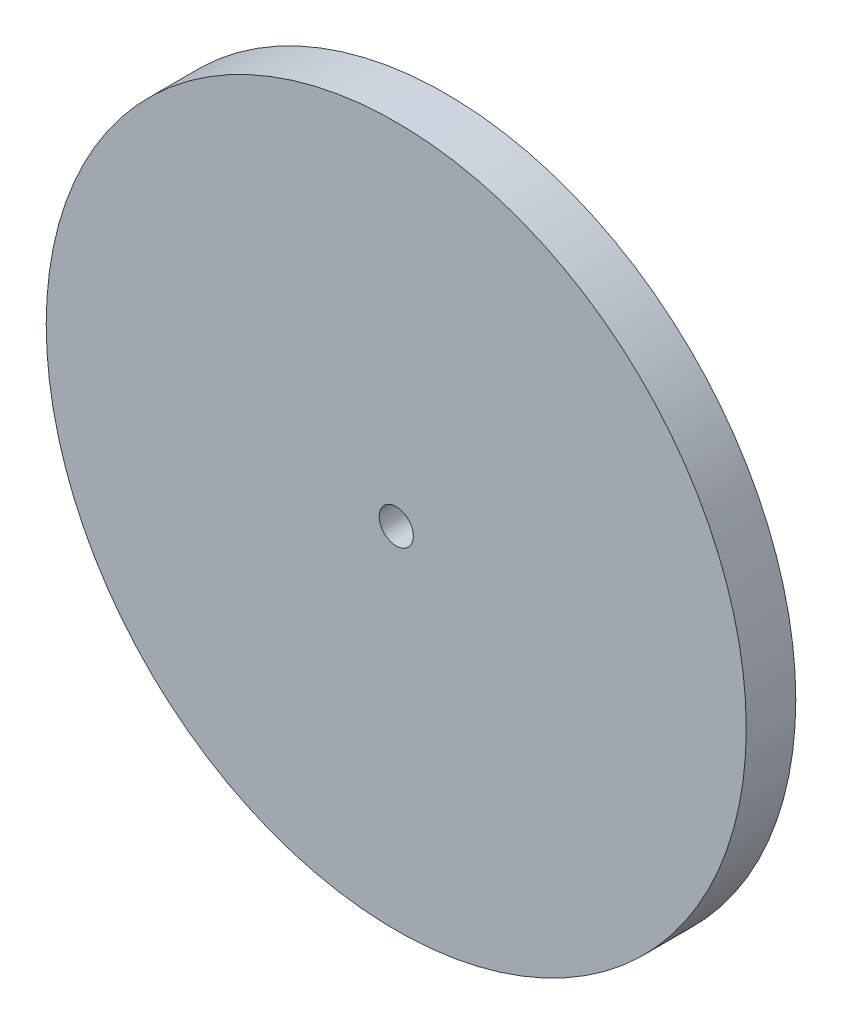
ISO-10303-21;
HEADER;
FILE_DESCRIPTION(('STEP AP214'),'2;1');
FILE_NAME('part.step','',(''),(''),'','','');
FILE_SCHEMA(('AUTOMOTIVE_DESIGN { 1 0 10303 214 1 1 1 1 }'));
ENDSEC;
DATA;
#1=APPLICATION_CONTEXT('core data for automotive mechanical design processes');
#2=APPLICATION_PROTOCOL_DEFINITION('international standard','automotive_design',2000,#1);
#3=PRODUCT_CONTEXT('',#1,'mechanical');
#4=PRODUCT('Part','Part','',(#3));
#5=PRODUCT_RELATED_PRODUCT_CATEGORY('part','',(#4));
#6=PRODUCT_DEFINITION_FORMATION('','',#4);
#7=PRODUCT_DEFINITION_CONTEXT('part definition',#1,'design');
#8=PRODUCT_DEFINITION('design','',#6,#7);
#9=PRODUCT_DEFINITION_SHAPE('','',#8);
#10=(LENGTH_UNIT() NAMED_UNIT(*) SI_UNIT(.MILLI.,.METRE.));
#11=(NAMED_UNIT(*) PLANE_ANGLE_UNIT() SI_UNIT($,.RADIAN.));
#12=(NAMED_UNIT(*) SI_UNIT($,.STERADIAN.) SOLID_ANGLE_UNIT());
#13=UNCERTAINTY_MEASURE_WITH_UNIT(LENGTH_MEASURE(1.E-05),#10,'distance_accuracy_value','');
#14=(GEOMETRIC_REPRESENTATION_CONTEXT(3) GLOBAL_UNCERTAINTY_ASSIGNED_CONTEXT((#13)) GLOBAL_UNIT_ASSIGNED_CONTEXT((#10,
#11,#12)) REPRESENTATION_CONTEXT('',''));
#15=CARTESIAN_POINT('',(0.,0.,0.));
#16=DIRECTION('',(0.,0.,1.));
#17=DIRECTION('',(1.,0.,0.));
#18=AXIS2_PLACEMENT_3D('',#15,#16,#17);
#19=CARTESIAN_POINT('',(0.,0.,5.8));
#20=DIRECTION('',(0.,0.,1.));
#21=DIRECTION('',(1.,0.,0.));
#22=AXIS2_PLACEMENT_3D('',#19,#20,#21);
#23=PLANE('',#22);
#24=CARTESIAN_POINT('',(0.,0.,5.8));
#25=DIRECTION('',(0.,0.,1.));
#26=DIRECTION('',(1.,0.,0.));
#27=AXIS2_PLACEMENT_3D('',#24,#25,#26);
#28=CIRCLE('',#27,41.);
#29=CARTESIAN_POINT('',(41.,0.,5.8));
#30=VERTEX_POINT('',#29);
#31=EDGE_CURVE('E10',#30,#30,#28,.T.);
#32=ORIENTED_EDGE('',*,*,#31,.T.);
#33=EDGE_LOOP('',(#32));
#34=FACE_BOUND('',#33,.T.);
#35=CARTESIAN_POINT('',(0.,0.,5.8));
#36=DIRECTION('',(0.,0.,1.));
#37=DIRECTION('',(1.,0.,0.));
#38=AXIS2_PLACEMENT_3D('',#35,#36,#37);
#39=CIRCLE('',#38,2.);
#40=CARTESIAN_POINT('',(2.,0.,5.8));
#41=VERTEX_POINT('',#40);
#42=EDGE_CURVE('E42',#41,#41,#39,.T.);
#43=ORIENTED_EDGE('',*,*,#42,.F.);
#44=EDGE_LOOP('',(#43));
#45=FACE_BOUND('',#44,.T.);
#46=ADVANCED_FACE('F31',(#34,#45),#23,.T.);
#47=CARTESIAN_POINT('',(0.,0.,0.));
#48=DIRECTION('',(0.,0.,1.));
#49=DIRECTION('',(1.,0.,0.));
#50=AXIS2_PLACEMENT_3D('',#47,#48,#49);
#51=PLANE('',#50);
#52=CARTESIAN_POINT('',(0.,0.,0.));
#53=DIRECTION('',(0.,0.,1.));
#54=DIRECTION('',(1.,0.,0.));
#55=AXIS2_PLACEMENT_3D('',#52,#53,#54);
#56=CIRCLE('',#55,41.);
#57=CARTESIAN_POINT('',(41.,0.,0.));
#58=VERTEX_POINT('',#57);
#59=EDGE_CURVE('E35',#58,#58,#56,.T.);
#60=ORIENTED_EDGE('',*,*,#59,.F.);
#61=EDGE_LOOP('',(#60));
#62=FACE_BOUND('',#61,.T.);
#63=CARTESIAN_POINT('',(0.,0.,0.));
#64=DIRECTION('',(0.,0.,1.));
#65=DIRECTION('',(1.,0.,0.));
#66=AXIS2_PLACEMENT_3D('',#63,#64,#65);
#67=CIRCLE('',#66,2.);
#68=CARTESIAN_POINT('',(2.,0.,0.));
#69=VERTEX_POINT('',#68);
#70=EDGE_CURVE('E44',#69,#69,#67,.T.);
#71=ORIENTED_EDGE('',*,*,#70,.T.);
#72=EDGE_LOOP('',(#71));
#73=FACE_BOUND('',#72,.T.);
#74=ADVANCED_FACE('F54',(#62,#73),#51,.F.);
#75=CARTESIAN_POINT('',(0.,0.,5.8));
#76=DIRECTION('',(0.,0.,-1.));
#77=DIRECTION('',(-1.,0.,0.));
#78=AXIS2_PLACEMENT_3D('',#75,#76,#77);
#79=CYLINDRICAL_SURFACE('',#78,41.);
#80=ORIENTED_EDGE('',*,*,#31,.F.);
#81=EDGE_LOOP('',(#80));
#82=FACE_BOUND('',#81,.T.);
#83=ORIENTED_EDGE('',*,*,#59,.T.);
#84=EDGE_LOOP('',(#83));
#85=FACE_BOUND('',#84,.T.);
#86=ADVANCED_FACE('F33',(#82,#85),#79,.T.);
#87=CARTESIAN_POINT('',(0.,0.,5.8));
#88=DIRECTION('',(0.,0.,-1.));
#89=DIRECTION('',(-1.,0.,0.));
#90=AXIS2_PLACEMENT_3D('',#87,#88,#89);
#91=CYLINDRICAL_SURFACE('',#90,2.);
#92=ORIENTED_EDGE('',*,*,#42,.T.);
#93=EDGE_LOOP('',(#92));
#94=FACE_BOUND('',#93,.T.);
#95=ORIENTED_EDGE('',*,*,#70,.F.);
#96=EDGE_LOOP('',(#95));
#97=FACE_BOUND('',#96,.T.);
#98=ADVANCED_FACE('F50',(#94,#97),#91,.F.);
#99=CLOSED_SHELL('',(#46,#74,#86,#98));
#100=MANIFOLD_SOLID_BREP('B2',#99);
#101=ADVANCED_BREP_SHAPE_REPRESENTATION('',(#18,#100),#14);
#102=SHAPE_DEFINITION_REPRESENTATION(#9,#101);
ENDSEC;
END-ISO-10303-21;
